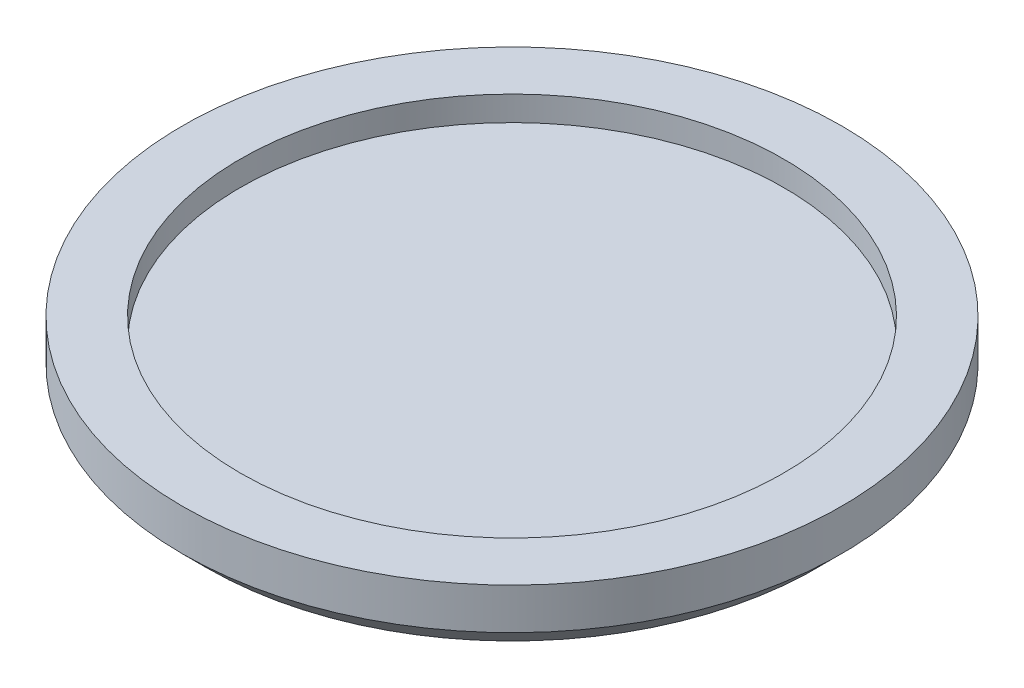
ISO-10303-21;
HEADER;
FILE_DESCRIPTION(('STEP AP214'),'2;1');
FILE_NAME('part.step','',(''),(''),'','','');
FILE_SCHEMA(('AUTOMOTIVE_DESIGN { 1 0 10303 214 1 1 1 1 }'));
ENDSEC;
DATA;
#1=APPLICATION_CONTEXT('core data for automotive mechanical design processes');
#2=APPLICATION_PROTOCOL_DEFINITION('international standard','automotive_design',2000,#1);
#3=PRODUCT_CONTEXT('',#1,'mechanical');
#4=PRODUCT('Part','Part','',(#3));
#5=PRODUCT_RELATED_PRODUCT_CATEGORY('part','',(#4));
#6=PRODUCT_DEFINITION_FORMATION('','',#4);
#7=PRODUCT_DEFINITION_CONTEXT('part definition',#1,'design');
#8=PRODUCT_DEFINITION('design','',#6,#7);
#9=PRODUCT_DEFINITION_SHAPE('','',#8);
#10=(LENGTH_UNIT() NAMED_UNIT(*) SI_UNIT(.MILLI.,.METRE.));
#11=(NAMED_UNIT(*) PLANE_ANGLE_UNIT() SI_UNIT($,.RADIAN.));
#12=(NAMED_UNIT(*) SI_UNIT($,.STERADIAN.) SOLID_ANGLE_UNIT());
#13=UNCERTAINTY_MEASURE_WITH_UNIT(LENGTH_MEASURE(1.E-05),#10,'distance_accuracy_value','');
#14=(GEOMETRIC_REPRESENTATION_CONTEXT(3) GLOBAL_UNCERTAINTY_ASSIGNED_CONTEXT((#13)) GLOBAL_UNIT_ASSIGNED_CONTEXT((#10,
#11,#12)) REPRESENTATION_CONTEXT('',''));
#15=CARTESIAN_POINT('',(0.,0.,0.));
#16=DIRECTION('',(0.,0.,1.));
#17=DIRECTION('',(1.,0.,0.));
#18=AXIS2_PLACEMENT_3D('',#15,#16,#17);
#19=CARTESIAN_POINT('',(0.,4.,0.));
#20=DIRECTION('',(0.,-1.,0.));
#21=DIRECTION('',(0.,0.,-1.));
#22=AXIS2_PLACEMENT_3D('',#19,#20,#21);
#23=CYLINDRICAL_SURFACE('',#22,20.);
#24=CARTESIAN_POINT('',(0.,1.5,0.));
#25=DIRECTION('',(0.,1.,0.));
#26=DIRECTION('',(0.,0.,1.));
#27=AXIS2_PLACEMENT_3D('',#24,#25,#26);
#28=CIRCLE('',#27,20.);
#29=CARTESIAN_POINT('',(0.,1.5,20.));
#30=VERTEX_POINT('',#29);
#31=EDGE_CURVE('E38',#30,#30,#28,.T.);
#32=ORIENTED_EDGE('',*,*,#31,.T.);
#33=EDGE_LOOP('',(#32));
#34=FACE_BOUND('',#33,.T.);
#35=CARTESIAN_POINT('',(0.,4.,0.));
#36=DIRECTION('',(0.,1.,0.));
#37=DIRECTION('',(0.,0.,1.));
#38=AXIS2_PLACEMENT_3D('',#35,#36,#37);
#39=CIRCLE('',#38,20.);
#40=CARTESIAN_POINT('',(0.,4.,20.));
#41=VERTEX_POINT('',#40);
#42=EDGE_CURVE('E42',#41,#41,#39,.T.);
#43=ORIENTED_EDGE('',*,*,#42,.F.);
#44=EDGE_LOOP('',(#43));
#45=FACE_BOUND('',#44,.T.);
#46=ADVANCED_FACE('F31',(#34,#45),#23,.T.);
#47=CARTESIAN_POINT('',(0.,4.,0.));
#48=DIRECTION('',(0.,1.,0.));
#49=DIRECTION('',(0.,0.,1.));
#50=AXIS2_PLACEMENT_3D('',#47,#48,#49);
#51=PLANE('',#50);
#52=CARTESIAN_POINT('',(0.,4.,0.));
#53=DIRECTION('',(0.,1.,0.));
#54=DIRECTION('',(0.,0.,1.));
#55=AXIS2_PLACEMENT_3D('',#52,#53,#54);
#56=CIRCLE('',#55,16.5);
#57=CARTESIAN_POINT('',(0.,4.,16.5));
#58=VERTEX_POINT('',#57);
#59=EDGE_CURVE('E49',#58,#58,#56,.T.);
#60=ORIENTED_EDGE('',*,*,#59,.F.);
#61=EDGE_LOOP('',(#60));
#62=FACE_BOUND('',#61,.T.);
#63=ORIENTED_EDGE('',*,*,#42,.T.);
#64=EDGE_LOOP('',(#63));
#65=FACE_BOUND('',#64,.T.);
#66=ADVANCED_FACE('F64',(#62,#65),#51,.T.);
#67=CARTESIAN_POINT('',(0.,0.,0.));
#68=DIRECTION('',(0.,1.,0.));
#69=DIRECTION('',(0.,0.,1.));
#70=AXIS2_PLACEMENT_3D('',#67,#68,#69);
#71=PLANE('',#70);
#72=CARTESIAN_POINT('',(0.,0.,0.));
#73=DIRECTION('',(0.,1.,0.));
#74=DIRECTION('',(0.,0.,1.));
#75=AXIS2_PLACEMENT_3D('',#72,#73,#74);
#76=CIRCLE('',#75,18.5);
#77=CARTESIAN_POINT('',(0.,0.,18.5));
#78=VERTEX_POINT('',#77);
#79=EDGE_CURVE('E10',#78,#78,#76,.F.);
#80=ORIENTED_EDGE('',*,*,#79,.T.);
#81=EDGE_LOOP('',(#80));
#82=FACE_BOUND('',#81,.T.);
#83=ADVANCED_FACE('F60',(#82),#71,.F.);
#84=CARTESIAN_POINT('',(0.,2.5,0.));
#85=DIRECTION('',(0.,1.,0.));
#86=DIRECTION('',(0.,0.,1.));
#87=AXIS2_PLACEMENT_3D('',#84,#85,#86);
#88=CYLINDRICAL_SURFACE('',#87,16.5);
#89=CARTESIAN_POINT('',(0.,2.5,0.));
#90=DIRECTION('',(0.,1.,0.));
#91=DIRECTION('',(0.,0.,1.));
#92=AXIS2_PLACEMENT_3D('',#89,#90,#91);
#93=CIRCLE('',#92,16.5);
#94=CARTESIAN_POINT('',(0.,2.5,16.5));
#95=VERTEX_POINT('',#94);
#96=EDGE_CURVE('E46',#95,#95,#93,.T.);
#97=ORIENTED_EDGE('',*,*,#96,.F.);
#98=EDGE_LOOP('',(#97));
#99=FACE_BOUND('',#98,.T.);
#100=ORIENTED_EDGE('',*,*,#59,.T.);
#101=EDGE_LOOP('',(#100));
#102=FACE_BOUND('',#101,.T.);
#103=ADVANCED_FACE('F57',(#99,#102),#88,.F.);
#104=CARTESIAN_POINT('',(0.,2.5,0.));
#105=DIRECTION('',(0.,1.,0.));
#106=DIRECTION('',(0.,0.,1.));
#107=AXIS2_PLACEMENT_3D('',#104,#105,#106);
#108=PLANE('',#107);
#109=ORIENTED_EDGE('',*,*,#96,.T.);
#110=EDGE_LOOP('',(#109));
#111=FACE_BOUND('',#110,.T.);
#112=ADVANCED_FACE('F55',(#111),#108,.T.);
#113=CARTESIAN_POINT('',(0.,1.5,0.));
#114=DIRECTION('',(0.,1.,0.));
#115=DIRECTION('',(0.,0.,1.));
#116=AXIS2_PLACEMENT_3D('',#113,#114,#115);
#117=CONICAL_SURFACE('',#116,20.,0.78539816339745);
#118=ORIENTED_EDGE('',*,*,#79,.F.);
#119=EDGE_LOOP('',(#118));
#120=FACE_BOUND('',#119,.T.);
#121=ORIENTED_EDGE('',*,*,#31,.F.);
#122=EDGE_LOOP('',(#121));
#123=FACE_BOUND('',#122,.T.);
#124=ADVANCED_FACE('F33',(#120,#123),#117,.T.);
#125=CLOSED_SHELL('',(#46,#66,#83,#103,#112,#124));
#126=MANIFOLD_SOLID_BREP('B2',#125);
#127=ADVANCED_BREP_SHAPE_REPRESENTATION('',(#18,#126),#14);
#128=SHAPE_DEFINITION_REPRESENTATION(#9,#127);
ENDSEC;
END-ISO-10303-21;
